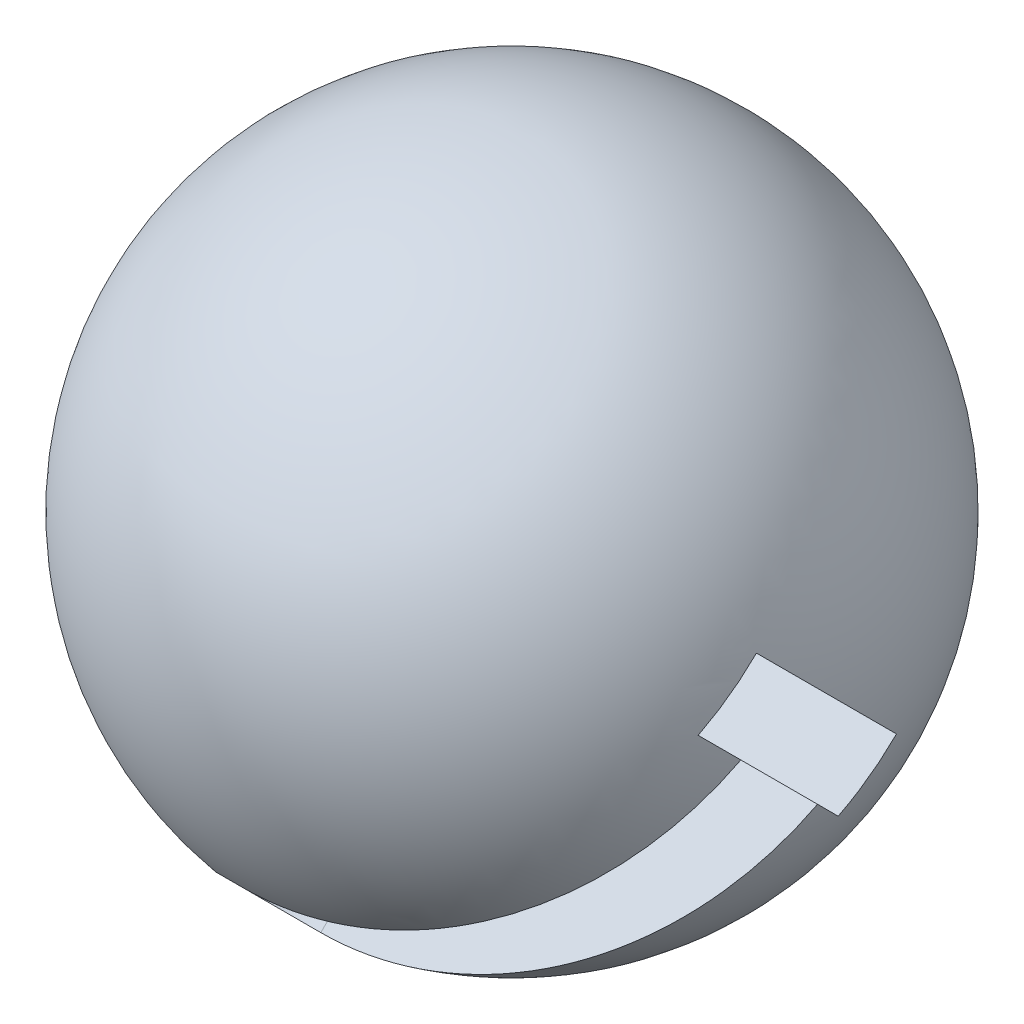
ISO-10303-21;
HEADER;
FILE_DESCRIPTION(('STEP AP214'),'2;1');
FILE_NAME('part.step','',(''),(''),'','','');
FILE_SCHEMA(('AUTOMOTIVE_DESIGN { 1 0 10303 214 1 1 1 1 }'));
ENDSEC;
DATA;
#1=APPLICATION_CONTEXT('core data for automotive mechanical design processes');
#2=APPLICATION_PROTOCOL_DEFINITION('international standard','automotive_design',2000,#1);
#3=PRODUCT_CONTEXT('',#1,'mechanical');
#4=PRODUCT('Part','Part','',(#3));
#5=PRODUCT_RELATED_PRODUCT_CATEGORY('part','',(#4));
#6=PRODUCT_DEFINITION_FORMATION('','',#4);
#7=PRODUCT_DEFINITION_CONTEXT('part definition',#1,'design');
#8=PRODUCT_DEFINITION('design','',#6,#7);
#9=PRODUCT_DEFINITION_SHAPE('','',#8);
#10=(LENGTH_UNIT() NAMED_UNIT(*) SI_UNIT(.MILLI.,.METRE.));
#11=(NAMED_UNIT(*) PLANE_ANGLE_UNIT() SI_UNIT($,.RADIAN.));
#12=(NAMED_UNIT(*) SI_UNIT($,.STERADIAN.) SOLID_ANGLE_UNIT());
#13=UNCERTAINTY_MEASURE_WITH_UNIT(LENGTH_MEASURE(1.E-05),#10,'distance_accuracy_value','');
#14=(GEOMETRIC_REPRESENTATION_CONTEXT(3) GLOBAL_UNCERTAINTY_ASSIGNED_CONTEXT((#13)) GLOBAL_UNIT_ASSIGNED_CONTEXT((#10,
#11,#12)) REPRESENTATION_CONTEXT('',''));
#15=CARTESIAN_POINT('',(0.,0.,0.));
#16=DIRECTION('',(0.,0.,1.));
#17=DIRECTION('',(1.,0.,0.));
#18=AXIS2_PLACEMENT_3D('',#15,#16,#17);
#19=CARTESIAN_POINT('',(-59.8752702323114,-26.5524119517395,76.9627361710177));
#20=DIRECTION('',(0.496280664568211,-0.613883336626646,-0.613883336626652));
#21=DIRECTION('',(0.,0.707106781186551,-0.707106781186544));
#22=AXIS2_PLACEMENT_3D('',#19,#20,#21);
#23=PLANE('',#22);
#24=DIRECTION('',(0.,-0.707106781186551,0.707106781186544));
#25=VECTOR('',#24,1.);
#26=CARTESIAN_POINT('',(-64.9745540607498,-28.6136146397825,74.9015334829747));
#27=LINE('',#26,#25);
#28=CARTESIAN_POINT('',(-64.9745540607498,-25.6084108197396,71.8963296629319));
#29=VERTEX_POINT('',#28);
#30=CARTESIAN_POINT('',(-64.9745540607498,-28.6136146397825,74.9015334829747));
#31=VERTEX_POINT('',#30);
#32=EDGE_CURVE('E226',#29,#31,#27,.T.);
#33=ORIENTED_EDGE('',*,*,#32,.F.);
#34=DIRECTION('',(-0.868162140372255,-0.350923423287945,-0.350923423287951));
#35=VECTOR('',#34,1.);
#36=CARTESIAN_POINT('',(-59.8752702323114,-23.5472081316966,73.9575323509749));
#37=LINE('',#36,#35);
#38=CARTESIAN_POINT('',(-65.0254459392502,-25.6289820372466,71.8757584454249));
#39=VERTEX_POINT('',#38);
#40=EDGE_CURVE('E77',#29,#39,#37,.T.);
#41=ORIENTED_EDGE('',*,*,#40,.T.);
#42=DIRECTION('',(0.,0.707106781186551,-0.707106781186544));
#43=VECTOR('',#42,1.);
#44=CARTESIAN_POINT('',(-65.0254459392502,-28.6341858572894,74.8809622654677));
#45=LINE('',#44,#43);
#46=CARTESIAN_POINT('',(-65.0254459392502,-28.6341858572894,74.8809622654677));
#47=VERTEX_POINT('',#46);
#48=EDGE_CURVE('E163',#47,#39,#45,.T.);
#49=ORIENTED_EDGE('',*,*,#48,.F.);
#50=DIRECTION('',(-0.868162140372255,-0.350923423287945,-0.350923423287951));
#51=VECTOR('',#50,1.);
#52=CARTESIAN_POINT('',(-59.8752702323114,-26.5524119517395,76.9627361710177));
#53=LINE('',#52,#51);
#54=EDGE_CURVE('E59',#31,#47,#53,.T.);
#55=ORIENTED_EDGE('',*,*,#54,.F.);
#56=EDGE_LOOP('',(#33,#41,#49,#55));
#57=FACE_BOUND('',#56,.T.);
#58=ADVANCED_FACE('F33',(#57),#23,.F.);
#59=CARTESIAN_POINT('',(0.,-51.7575740613787,51.7575740613781));
#60=DIRECTION('',(0.,0.707106781186552,-0.707106781186543));
#61=DIRECTION('',(0.,0.707106781186543,0.707106781186552));
#62=AXIS2_PLACEMENT_3D('',#59,#60,#61);
#63=PLANE('',#62);
#64=DIRECTION('',(0.868162140372255,0.350923423287946,0.35092342328795));
#65=VECTOR('',#64,1.);
#66=CARTESIAN_POINT('',(-70.1247297676886,-22.3265345734507,81.1886135493065));
#67=LINE('',#66,#65);
#68=CARTESIAN_POINT('',(-70.1247297676886,-22.3265345734507,81.1886135493065));
#69=VERTEX_POINT('',#68);
#70=CARTESIAN_POINT('',(-64.9745540607498,-20.2447606679007,83.2703874548565));
#71=VERTEX_POINT('',#70);
#72=EDGE_CURVE('E159',#69,#71,#67,.T.);
#73=ORIENTED_EDGE('',*,*,#72,.T.);
#74=DIRECTION('',(-1.,0.,0.));
#75=VECTOR('',#74,1.);
#76=CARTESIAN_POINT('',(-45.25,-20.2447606679007,83.2703874548565));
#77=LINE('',#76,#75);
#78=CARTESIAN_POINT('',(-46.6476494013485,-20.2447606679007,83.2703874548565));
#79=VERTEX_POINT('',#78);
#80=EDGE_CURVE('E143',#79,#71,#77,.T.);
#81=ORIENTED_EDGE('',*,*,#80,.F.);
#82=CARTESIAN_POINT('',(-65.,-24.4394732625951,79.0756748601621));
#83=DIRECTION('',(0.,0.707106781186546,-0.707106781186549));
#84=DIRECTION('',(0.,0.707106781186549,0.707106781186546));
#85=AXIS2_PLACEMENT_3D('',#82,#83,#84);
#86=CIRCLE('',#85,19.2873015219859);
#87=CARTESIAN_POINT('',(-45.9884903282249,-22.1413762237388,81.3737718990184));
#88=VERTEX_POINT('',#87);
#89=EDGE_CURVE('E189',#88,#79,#86,.F.);
#90=ORIENTED_EDGE('',*,*,#89,.F.);
#91=DIRECTION('',(-1.,0.,0.));
#92=VECTOR('',#91,1.);
#93=CARTESIAN_POINT('',(-45.25,-22.1413762237388,81.3737718990184));
#94=LINE('',#93,#92);
#95=CARTESIAN_POINT('',(-64.9745540607498,-22.1413762237388,81.3737718990184));
#96=VERTEX_POINT('',#95);
#97=EDGE_CURVE('E154',#88,#96,#94,.T.);
#98=ORIENTED_EDGE('',*,*,#97,.T.);
#99=DIRECTION('',(0.,-0.707106781186543,-0.707106781186552));
#100=VECTOR('',#99,1.);
#101=CARTESIAN_POINT('',(-64.9745540607498,-51.7575740613787,51.7575740613781));
#102=LINE('',#101,#100);
#103=CARTESIAN_POINT('',(-64.9745540607498,-22.141446663078,81.3737014596792));
#104=VERTEX_POINT('',#103);
#105=EDGE_CURVE('E221',#96,#104,#102,.T.);
#106=ORIENTED_EDGE('',*,*,#105,.T.);
#107=CARTESIAN_POINT('',(-65.,-24.4394732625951,79.0756748601621));
#108=DIRECTION('',(0.,0.707106781186552,-0.707106781186543));
#109=DIRECTION('',(0.,0.707106781186543,0.707106781186552));
#110=AXIS2_PLACEMENT_3D('',#107,#108,#109);
#111=CIRCLE('',#110,3.25000000000001);
#112=CARTESIAN_POINT('',(-64.9745540607498,-26.7374998621121,76.777648260645));
#113=VERTEX_POINT('',#112);
#114=EDGE_CURVE('E228',#113,#104,#111,.T.);
#115=ORIENTED_EDGE('',*,*,#114,.F.);
#116=CARTESIAN_POINT('',(-64.9745540607498,-26.7375703014513,76.7775778213058));
#117=VERTEX_POINT('',#116);
#118=EDGE_CURVE('E212',#113,#117,#102,.T.);
#119=ORIENTED_EDGE('',*,*,#118,.T.);
#120=DIRECTION('',(-1.,0.,0.));
#121=VECTOR('',#120,1.);
#122=CARTESIAN_POINT('',(-45.25,-26.7375703014513,76.7775778213058));
#123=LINE('',#122,#121);
#124=CARTESIAN_POINT('',(-45.9884903282249,-26.7375703014513,76.7775778213058));
#125=VERTEX_POINT('',#124);
#126=EDGE_CURVE('E206',#125,#117,#123,.T.);
#127=ORIENTED_EDGE('',*,*,#126,.F.);
#128=CARTESIAN_POINT('',(-65.,-24.439473262595,79.0756748601621));
#129=DIRECTION('',(0.,0.707106781186541,-0.707106781186554));
#130=DIRECTION('',(0.,0.707106781186554,0.707106781186541));
#131=AXIS2_PLACEMENT_3D('',#128,#129,#130);
#132=CIRCLE('',#131,19.2873015219859);
#133=CARTESIAN_POINT('',(-46.6476494013485,-28.6341858572895,74.8809622654677));
#134=VERTEX_POINT('',#133);
#135=EDGE_CURVE('E196',#134,#125,#132,.F.);
#136=ORIENTED_EDGE('',*,*,#135,.F.);
#137=DIRECTION('',(-1.,0.,0.));
#138=VECTOR('',#137,1.);
#139=CARTESIAN_POINT('',(-45.25,-28.6341858572894,74.8809622654677));
#140=LINE('',#139,#138);
#141=CARTESIAN_POINT('',(-64.9745540607498,-28.6341858572894,74.8809622654677));
#142=VERTEX_POINT('',#141);
#143=EDGE_CURVE('E213',#134,#142,#140,.T.);
#144=ORIENTED_EDGE('',*,*,#143,.T.);
#145=DIRECTION('',(0.,-0.707106781186554,-0.707106781186541));
#146=VECTOR('',#145,1.);
#147=CARTESIAN_POINT('',(-64.9745540607498,-26.7375703014513,76.7775778213058));
#148=LINE('',#147,#146);
#149=EDGE_CURVE('E286',#31,#142,#148,.T.);
#150=ORIENTED_EDGE('',*,*,#149,.F.);
#151=ORIENTED_EDGE('',*,*,#54,.T.);
#152=DIRECTION('',(-0.863872733109221,0.356176852834656,0.356176852834661));
#153=VECTOR('',#152,1.);
#154=CARTESIAN_POINT('',(-65.0254459392502,-28.6341858572894,74.8809622654677));
#155=LINE('',#154,#153);
#156=CARTESIAN_POINT('',(-70.1501757069388,-26.521247168145,76.9939009546121));
#157=VERTEX_POINT('',#156);
#158=EDGE_CURVE('E170',#47,#157,#155,.T.);
#159=ORIENTED_EDGE('',*,*,#158,.T.);
#160=DIRECTION('',(0.00428940726303311,0.707100276122602,0.70710027612261));
#161=VECTOR('',#160,1.);
#162=CARTESIAN_POINT('',(-70.1501757069388,-26.521247168145,76.9939009546121));
#163=LINE('',#162,#161);
#164=EDGE_CURVE('E167',#157,#69,#163,.T.);
#165=ORIENTED_EDGE('',*,*,#164,.T.);
#166=EDGE_LOOP('',(#73,#81,#90,#98,#106,#115,#119,#127,#136,#144,#150,#151,#159,#165));
#167=FACE_BOUND('',#166,.T.);
#168=ADVANCED_FACE('F166',(#167),#63,.T.);
#169=CARTESIAN_POINT('',(-65.,-41.1842694425523,95.8204710401192));
#170=DIRECTION('',(0.,0.707106781186551,-0.707106781186544));
#171=DIRECTION('',(0.,0.707106781186544,0.707106781186551));
#172=AXIS2_PLACEMENT_3D('',#169,#170,#171);
#173=CYLINDRICAL_SURFACE('',#172,3.25000000000001);
#174=DIRECTION('',(0.,0.707106781186551,-0.707106781186544));
#175=VECTOR('',#174,1.);
#176=CARTESIAN_POINT('',(-64.9745540607498,-43.4822960420694,93.5224444406021));
#177=LINE('',#176,#175);
#178=CARTESIAN_POINT('',(-64.9745540607498,-37.5072733560252,87.5474217545581));
#179=VERTEX_POINT('',#178);
#180=EDGE_CURVE('E224',#113,#179,#177,.F.);
#181=ORIENTED_EDGE('',*,*,#180,.F.);
#182=ORIENTED_EDGE('',*,*,#114,.T.);
#183=DIRECTION('',(0.,0.707106781186551,-0.707106781186544));
#184=VECTOR('',#183,1.);
#185=CARTESIAN_POINT('',(-64.9745540607498,-38.8862428430353,98.1184976396362));
#186=LINE('',#185,#184);
#187=CARTESIAN_POINT('',(-64.9745540607498,-32.9112201569912,92.1434749535922));
#188=VERTEX_POINT('',#187);
#189=EDGE_CURVE('E153',#188,#104,#186,.T.);
#190=ORIENTED_EDGE('',*,*,#189,.F.);
#191=CARTESIAN_POINT('',(-65.,-35.2092467565082,89.8454483540751));
#192=DIRECTION('',(0.,0.707106781186551,-0.707106781186544));
#193=DIRECTION('',(0.,0.707106781186544,0.707106781186551));
#194=AXIS2_PLACEMENT_3D('',#191,#192,#193);
#195=CIRCLE('',#194,3.25000000000001);
#196=EDGE_CURVE('E177',#188,#179,#195,.F.);
#197=ORIENTED_EDGE('',*,*,#196,.T.);
#198=EDGE_LOOP('',(#181,#182,#190,#197));
#199=FACE_BOUND('',#198,.T.);
#200=ADVANCED_FACE('F253',(#199),#173,.F.);
#201=CARTESIAN_POINT('',(-65.,-21.4342694425522,76.0704710401193));
#202=DIRECTION('',(0.,1.,0.));
#203=DIRECTION('',(0.,0.,-1.));
#204=AXIS2_PLACEMENT_3D('',#201,#202,#203);
#205=SPHERICAL_SURFACE('',#204,19.75);
#206=CARTESIAN_POINT('',(-65.,-23.7323664814085,73.772374001263));
#207=DIRECTION('',(0.,0.707106781186545,0.70710678118655));
#208=DIRECTION('',(0.,-0.70710678118655,0.707106781186545));
#209=AXIS2_PLACEMENT_3D('',#206,#207,#208);
#210=CIRCLE('',#209,19.4807597387782);
#211=CARTESIAN_POINT('',(-64.9745540607498,-37.5073320440547,87.5473395639091));
#212=VERTEX_POINT('',#211);
#213=EDGE_CURVE('E37',#125,#212,#210,.F.);
#214=ORIENTED_EDGE('',*,*,#213,.T.);
#215=CARTESIAN_POINT('',(-64.9745540607498,-21.4342694425522,76.0704710401193));
#216=DIRECTION('',(1.,0.,0.));
#217=DIRECTION('',(0.,0.,-1.));
#218=AXIS2_PLACEMENT_3D('',#215,#216,#217);
#219=CIRCLE('',#218,19.7499836076938);
#220=EDGE_CURVE('E11',#212,#179,#219,.F.);
#221=ORIENTED_EDGE('',*,*,#220,.T.);
#222=ORIENTED_EDGE('',*,*,#196,.F.);
#223=CARTESIAN_POINT('',(-64.9745540607498,-32.9111379663422,92.1435336416217));
#224=VERTEX_POINT('',#223);
#225=EDGE_CURVE('E43',#188,#224,#219,.F.);
#226=ORIENTED_EDGE('',*,*,#225,.T.);
#227=CARTESIAN_POINT('',(-65.,-19.136172403696,78.3685680789756));
#228=DIRECTION('',(0.,-0.707106781186544,-0.707106781186551));
#229=DIRECTION('',(0.,0.707106781186551,-0.707106781186544));
#230=AXIS2_PLACEMENT_3D('',#227,#228,#229);
#231=CIRCLE('',#230,19.4807597387782);
#232=EDGE_CURVE('E186',#224,#88,#231,.F.);
#233=ORIENTED_EDGE('',*,*,#232,.T.);
#234=ORIENTED_EDGE('',*,*,#89,.T.);
#235=CARTESIAN_POINT('',(-65.,-17.2395568478578,80.2651836348137));
#236=DIRECTION('',(0.,-0.707106781186547,-0.707106781186547));
#237=DIRECTION('',(0.,0.707106781186548,-0.707106781186548));
#238=AXIS2_PLACEMENT_3D('',#235,#236,#237);
#239=CIRCLE('',#238,18.8380272984149);
#240=CARTESIAN_POINT('',(-46.1619727015851,-17.2395568478579,80.2651836348137));
#241=VERTEX_POINT('',#240);
#242=EDGE_CURVE('E150',#79,#241,#239,.F.);
#243=ORIENTED_EDGE('',*,*,#242,.T.);
#244=CARTESIAN_POINT('',(-65.,-21.4342694425522,76.0704710401193));
#245=DIRECTION('',(0.,-0.707106781186552,0.707106781186543));
#246=DIRECTION('',(0.,-0.707106781186543,-0.707106781186552));
#247=AXIS2_PLACEMENT_3D('',#244,#245,#246);
#248=CIRCLE('',#247,19.75);
#249=CARTESIAN_POINT('',(-46.1619727015851,-25.6289820372466,71.8757584454249));
#250=VERTEX_POINT('',#249);
#251=EDGE_CURVE('E192',#241,#250,#248,.F.);
#252=ORIENTED_EDGE('',*,*,#251,.T.);
#253=CARTESIAN_POINT('',(-65.,-25.6289820372466,71.8757584454249));
#254=DIRECTION('',(0.,0.707106781186548,0.707106781186547));
#255=DIRECTION('',(0.,-0.707106781186547,0.707106781186548));
#256=AXIS2_PLACEMENT_3D('',#253,#254,#255);
#257=CIRCLE('',#256,18.8380272984149);
#258=EDGE_CURVE('E194',#250,#134,#257,.F.);
#259=ORIENTED_EDGE('',*,*,#258,.T.);
#260=ORIENTED_EDGE('',*,*,#135,.T.);
#261=EDGE_LOOP('',(#214,#221,#222,#226,#233,#234,#243,#252,#259,#260));
#262=FACE_BOUND('',#261,.T.);
#263=ADVANCED_FACE('F35',(#262),#205,.T.);
#264=CARTESIAN_POINT('',(-65.0254459392502,-28.6341858572894,74.8809622654677));
#265=DIRECTION('',(-0.50371013588214,-0.610850267663684,-0.61085026766369));
#266=DIRECTION('',(0.,0.707106781186551,-0.707106781186544));
#267=AXIS2_PLACEMENT_3D('',#264,#265,#266);
#268=PLANE('',#267);
#269=DIRECTION('',(-0.863872733109221,0.356176852834656,0.356176852834661));
#270=VECTOR('',#269,1.);
#271=CARTESIAN_POINT('',(-65.0254459392502,-25.6289820372466,71.8757584454249));
#272=LINE('',#271,#270);
#273=CARTESIAN_POINT('',(-70.1501757069388,-23.5160433481022,73.9886971345693));
#274=VERTEX_POINT('',#273);
#275=EDGE_CURVE('E174',#39,#274,#272,.T.);
#276=ORIENTED_EDGE('',*,*,#275,.T.);
#277=DIRECTION('',(0.,0.707106781186551,-0.707106781186544));
#278=VECTOR('',#277,1.);
#279=CARTESIAN_POINT('',(-70.1501757069388,-26.521247168145,76.9939009546121));
#280=LINE('',#279,#278);
#281=EDGE_CURVE('E83',#157,#274,#280,.T.);
#282=ORIENTED_EDGE('',*,*,#281,.F.);
#283=ORIENTED_EDGE('',*,*,#158,.F.);
#284=ORIENTED_EDGE('',*,*,#48,.T.);
#285=EDGE_LOOP('',(#276,#282,#283,#284));
#286=FACE_BOUND('',#285,.T.);
#287=ADVANCED_FACE('F231',(#286),#268,.F.);
#288=CARTESIAN_POINT('',(-70.1247297676886,-22.3265345734507,81.1886135493065));
#289=DIRECTION('',(-0.496280664568211,0.613883336626646,0.613883336626652));
#290=DIRECTION('',(0.,-0.707106781186551,0.707106781186544));
#291=AXIS2_PLACEMENT_3D('',#288,#289,#290);
#292=PLANE('',#291);
#293=DIRECTION('',(0.868162140372255,0.350923423287946,0.35092342328795));
#294=VECTOR('',#293,1.);
#295=CARTESIAN_POINT('',(-70.1247297676886,-19.3213307534078,78.1834097292637));
#296=LINE('',#295,#294);
#297=CARTESIAN_POINT('',(-70.1247297676886,-19.3213307534078,78.1834097292637));
#298=VERTEX_POINT('',#297);
#299=CARTESIAN_POINT('',(-64.9745540607498,-17.2395568478579,80.2651836348137));
#300=VERTEX_POINT('',#299);
#301=EDGE_CURVE('E162',#298,#300,#296,.T.);
#302=ORIENTED_EDGE('',*,*,#301,.T.);
#303=DIRECTION('',(0.,0.707106781186551,-0.707106781186544));
#304=VECTOR('',#303,1.);
#305=CARTESIAN_POINT('',(-64.9745540607498,-20.2447606679007,83.2703874548565));
#306=LINE('',#305,#304);
#307=EDGE_CURVE('E147',#71,#300,#306,.T.);
#308=ORIENTED_EDGE('',*,*,#307,.F.);
#309=ORIENTED_EDGE('',*,*,#72,.F.);
#310=DIRECTION('',(0.,0.707106781186551,-0.707106781186544));
#311=VECTOR('',#310,1.);
#312=CARTESIAN_POINT('',(-70.1247297676886,-22.3265345734507,81.1886135493065));
#313=LINE('',#312,#311);
#314=EDGE_CURVE('E164',#69,#298,#313,.T.);
#315=ORIENTED_EDGE('',*,*,#314,.T.);
#316=EDGE_LOOP('',(#302,#308,#309,#315));
#317=FACE_BOUND('',#316,.T.);
#318=ADVANCED_FACE('F158',(#317),#292,.F.);
#319=CARTESIAN_POINT('',(-70.1501757069388,-26.521247168145,76.9939009546121));
#320=DIRECTION('',(-0.99999080045035,0.00303306896296152,0.00303306896296156));
#321=DIRECTION('',(0.0030330829144279,0.,0.999995400193438));
#322=AXIS2_PLACEMENT_3D('',#319,#320,#321);
#323=PLANE('',#322);
#324=DIRECTION('',(0.00428940726303311,0.707100276122602,0.70710027612261));
#325=VECTOR('',#324,1.);
#326=CARTESIAN_POINT('',(-70.1501757069388,-23.5160433481022,73.9886971345693));
#327=LINE('',#326,#325);
#328=EDGE_CURVE('E176',#274,#298,#327,.T.);
#329=ORIENTED_EDGE('',*,*,#328,.T.);
#330=ORIENTED_EDGE('',*,*,#314,.F.);
#331=ORIENTED_EDGE('',*,*,#164,.F.);
#332=ORIENTED_EDGE('',*,*,#281,.T.);
#333=EDGE_LOOP('',(#329,#330,#331,#332));
#334=FACE_BOUND('',#333,.T.);
#335=ADVANCED_FACE('F238',(#334),#323,.F.);
#336=CARTESIAN_POINT('',(0.,-48.7523702413358,48.7523702413353));
#337=DIRECTION('',(0.,0.707106781186552,-0.707106781186543));
#338=DIRECTION('',(0.,0.707106781186543,0.707106781186552));
#339=AXIS2_PLACEMENT_3D('',#336,#337,#338);
#340=PLANE('',#339);
#341=ORIENTED_EDGE('',*,*,#40,.F.);
#342=DIRECTION('',(0.,0.707106781186543,0.707106781186552));
#343=VECTOR('',#342,1.);
#344=CARTESIAN_POINT('',(-64.9745540607498,-17.2395568478579,80.2651836348137));
#345=LINE('',#344,#343);
#346=CARTESIAN_POINT('',(-64.9745540607498,-25.6289820372466,71.8757584454249));
#347=VERTEX_POINT('',#346);
#348=EDGE_CURVE('E294',#347,#29,#345,.T.);
#349=ORIENTED_EDGE('',*,*,#348,.F.);
#350=DIRECTION('',(-1.,0.,0.));
#351=VECTOR('',#350,1.);
#352=CARTESIAN_POINT('',(-45.25,-25.6289820372466,71.8757584454249));
#353=LINE('',#352,#351);
#354=EDGE_CURVE('E216',#250,#347,#353,.T.);
#355=ORIENTED_EDGE('',*,*,#354,.F.);
#356=ORIENTED_EDGE('',*,*,#251,.F.);
#357=DIRECTION('',(-1.,0.,0.));
#358=VECTOR('',#357,1.);
#359=CARTESIAN_POINT('',(-45.25,-17.2395568478579,80.2651836348137));
#360=LINE('',#359,#358);
#361=EDGE_CURVE('E296',#241,#300,#360,.T.);
#362=ORIENTED_EDGE('',*,*,#361,.T.);
#363=ORIENTED_EDGE('',*,*,#301,.F.);
#364=ORIENTED_EDGE('',*,*,#328,.F.);
#365=ORIENTED_EDGE('',*,*,#275,.F.);
#366=EDGE_LOOP('',(#341,#349,#355,#356,#362,#363,#364,#365));
#367=FACE_BOUND('',#366,.T.);
#368=ADVANCED_FACE('F235',(#367),#340,.F.);
#369=CARTESIAN_POINT('',(-64.9745540607498,0.,0.));
#370=DIRECTION('',(1.,0.,0.));
#371=DIRECTION('',(0.,0.,-1.));
#372=AXIS2_PLACEMENT_3D('',#369,#370,#371);
#373=PLANE('',#372);
#374=ORIENTED_EDGE('',*,*,#32,.T.);
#375=ORIENTED_EDGE('',*,*,#149,.T.);
#376=DIRECTION('',(0.,0.707106781186547,-0.707106781186548));
#377=VECTOR('',#376,1.);
#378=CARTESIAN_POINT('',(-64.9745540607498,-25.6289820372466,71.8757584454249));
#379=LINE('',#378,#377);
#380=EDGE_CURVE('E291',#142,#347,#379,.T.);
#381=ORIENTED_EDGE('',*,*,#380,.T.);
#382=ORIENTED_EDGE('',*,*,#348,.T.);
#383=EDGE_LOOP('',(#374,#375,#381,#382));
#384=FACE_BOUND('',#383,.T.);
#385=ADVANCED_FACE('F245',(#384),#373,.T.);
#386=ORIENTED_EDGE('',*,*,#180,.T.);
#387=ORIENTED_EDGE('',*,*,#220,.F.);
#388=DIRECTION('',(0.,0.70710678118655,-0.707106781186545));
#389=VECTOR('',#388,1.);
#390=CARTESIAN_POINT('',(-64.9745540607498,-26.7375703014513,76.7775778213058));
#391=LINE('',#390,#389);
#392=EDGE_CURVE('E208',#212,#117,#391,.T.);
#393=ORIENTED_EDGE('',*,*,#392,.T.);
#394=ORIENTED_EDGE('',*,*,#118,.F.);
#395=EDGE_LOOP('',(#386,#387,#393,#394));
#396=FACE_BOUND('',#395,.T.);
#397=ADVANCED_FACE('F262',(#396),#373,.T.);
#398=CARTESIAN_POINT('',(-45.25,-17.2395568478579,80.2651836348137));
#399=DIRECTION('',(0.,-0.707106781186547,-0.707106781186547));
#400=DIRECTION('',(0.,0.707106781186548,-0.707106781186548));
#401=AXIS2_PLACEMENT_3D('',#398,#399,#400);
#402=PLANE('',#401);
#403=ORIENTED_EDGE('',*,*,#80,.T.);
#404=ORIENTED_EDGE('',*,*,#307,.T.);
#405=ORIENTED_EDGE('',*,*,#361,.F.);
#406=ORIENTED_EDGE('',*,*,#242,.F.);
#407=EDGE_LOOP('',(#403,#404,#405,#406));
#408=FACE_BOUND('',#407,.T.);
#409=ADVANCED_FACE('F145',(#408),#402,.T.);
#410=CARTESIAN_POINT('',(-45.25,-22.1413762237388,81.3737718990184));
#411=DIRECTION('',(0.,-0.707106781186544,-0.707106781186551));
#412=DIRECTION('',(0.,0.707106781186551,-0.707106781186544));
#413=AXIS2_PLACEMENT_3D('',#410,#411,#412);
#414=PLANE('',#413);
#415=DIRECTION('',(0.,-0.707106781186551,0.707106781186544));
#416=VECTOR('',#415,1.);
#417=CARTESIAN_POINT('',(-64.9745540607498,-22.1413762237388,81.3737718990184));
#418=LINE('',#417,#416);
#419=EDGE_CURVE('E50',#96,#224,#418,.T.);
#420=ORIENTED_EDGE('',*,*,#419,.F.);
#421=ORIENTED_EDGE('',*,*,#97,.F.);
#422=ORIENTED_EDGE('',*,*,#232,.F.);
#423=EDGE_LOOP('',(#420,#421,#422));
#424=FACE_BOUND('',#423,.T.);
#425=ADVANCED_FACE('F261',(#424),#414,.T.);
#426=CARTESIAN_POINT('',(-45.25,-26.7375703014513,76.7775778213058));
#427=DIRECTION('',(0.,0.707106781186545,0.70710678118655));
#428=DIRECTION('',(0.,-0.70710678118655,0.707106781186545));
#429=AXIS2_PLACEMENT_3D('',#426,#427,#428);
#430=PLANE('',#429);
#431=ORIENTED_EDGE('',*,*,#126,.T.);
#432=ORIENTED_EDGE('',*,*,#392,.F.);
#433=ORIENTED_EDGE('',*,*,#213,.F.);
#434=EDGE_LOOP('',(#431,#432,#433));
#435=FACE_BOUND('',#434,.T.);
#436=ADVANCED_FACE('F205',(#435),#430,.T.);
#437=CARTESIAN_POINT('',(-45.25,-25.6289820372466,71.8757584454249));
#438=DIRECTION('',(0.,0.707106781186548,0.707106781186547));
#439=DIRECTION('',(0.,-0.707106781186547,0.707106781186548));
#440=AXIS2_PLACEMENT_3D('',#437,#438,#439);
#441=PLANE('',#440);
#442=ORIENTED_EDGE('',*,*,#354,.T.);
#443=ORIENTED_EDGE('',*,*,#380,.F.);
#444=ORIENTED_EDGE('',*,*,#143,.F.);
#445=ORIENTED_EDGE('',*,*,#258,.F.);
#446=EDGE_LOOP('',(#442,#443,#444,#445));
#447=FACE_BOUND('',#446,.T.);
#448=ADVANCED_FACE('F268',(#447),#441,.T.);
#449=ORIENTED_EDGE('',*,*,#419,.T.);
#450=ORIENTED_EDGE('',*,*,#225,.F.);
#451=ORIENTED_EDGE('',*,*,#189,.T.);
#452=ORIENTED_EDGE('',*,*,#105,.F.);
#453=EDGE_LOOP('',(#449,#450,#451,#452));
#454=FACE_BOUND('',#453,.T.);
#455=ADVANCED_FACE('F271',(#454),#373,.T.);
#456=CLOSED_SHELL('',(#58,#168,#200,#263,#287,#318,#335,#368,#385,#397,#409,#425,#436,#448,#455));
#457=MANIFOLD_SOLID_BREP('B2',#456);
#458=ADVANCED_BREP_SHAPE_REPRESENTATION('',(#18,#457),#14);
#459=SHAPE_DEFINITION_REPRESENTATION(#9,#458);
ENDSEC;
END-ISO-10303-21;
